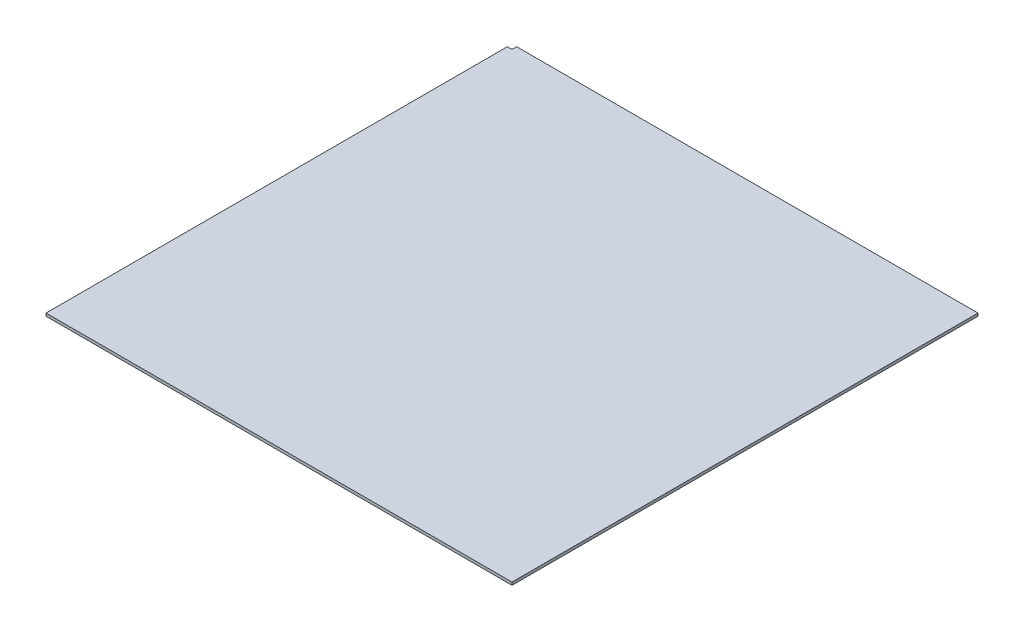
ISO-10303-21;
HEADER;
FILE_DESCRIPTION(('STEP AP214'),'2;1');
FILE_NAME('part.step','',(''),(''),'','','');
FILE_SCHEMA(('AUTOMOTIVE_DESIGN { 1 0 10303 214 1 1 1 1 }'));
ENDSEC;
DATA;
#1=APPLICATION_CONTEXT('core data for automotive mechanical design processes');
#2=APPLICATION_PROTOCOL_DEFINITION('international standard','automotive_design',2000,#1);
#3=PRODUCT_CONTEXT('',#1,'mechanical');
#4=PRODUCT('Part','Part','',(#3));
#5=PRODUCT_RELATED_PRODUCT_CATEGORY('part','',(#4));
#6=PRODUCT_DEFINITION_FORMATION('','',#4);
#7=PRODUCT_DEFINITION_CONTEXT('part definition',#1,'design');
#8=PRODUCT_DEFINITION('design','',#6,#7);
#9=PRODUCT_DEFINITION_SHAPE('','',#8);
#10=(LENGTH_UNIT() NAMED_UNIT(*) SI_UNIT(.MILLI.,.METRE.));
#11=(NAMED_UNIT(*) PLANE_ANGLE_UNIT() SI_UNIT($,.RADIAN.));
#12=(NAMED_UNIT(*) SI_UNIT($,.STERADIAN.) SOLID_ANGLE_UNIT());
#13=UNCERTAINTY_MEASURE_WITH_UNIT(LENGTH_MEASURE(1.E-05),#10,'distance_accuracy_value','');
#14=(GEOMETRIC_REPRESENTATION_CONTEXT(3) GLOBAL_UNCERTAINTY_ASSIGNED_CONTEXT((#13)) GLOBAL_UNIT_ASSIGNED_CONTEXT((#10,
#11,#12)) REPRESENTATION_CONTEXT('',''));
#15=CARTESIAN_POINT('',(0.,0.,0.));
#16=DIRECTION('',(0.,0.,1.));
#17=DIRECTION('',(1.,0.,0.));
#18=AXIS2_PLACEMENT_3D('',#15,#16,#17);
#19=CARTESIAN_POINT('',(500.,3.,-500.));
#20=DIRECTION('',(-1.,0.,0.));
#21=DIRECTION('',(0.,0.,1.));
#22=AXIS2_PLACEMENT_3D('',#19,#20,#21);
#23=PLANE('',#22);
#24=DIRECTION('',(0.,0.,-1.));
#25=VECTOR('',#24,1.);
#26=CARTESIAN_POINT('',(500.,-3.,-500.));
#27=LINE('',#26,#25);
#28=CARTESIAN_POINT('',(500.,-3.,500.));
#29=VERTEX_POINT('',#28);
#30=CARTESIAN_POINT('',(500.,-3.,-500.));
#31=VERTEX_POINT('',#30);
#32=EDGE_CURVE('E116',#29,#31,#27,.T.);
#33=ORIENTED_EDGE('',*,*,#32,.T.);
#34=DIRECTION('',(0.,-1.,0.));
#35=VECTOR('',#34,1.);
#36=CARTESIAN_POINT('',(500.,3.,-500.));
#37=LINE('',#36,#35);
#38=CARTESIAN_POINT('',(500.,3.,-500.));
#39=VERTEX_POINT('',#38);
#40=EDGE_CURVE('E11',#39,#31,#37,.T.);
#41=ORIENTED_EDGE('',*,*,#40,.F.);
#42=DIRECTION('',(0.,0.,-1.));
#43=VECTOR('',#42,1.);
#44=CARTESIAN_POINT('',(500.,3.,-500.));
#45=LINE('',#44,#43);
#46=CARTESIAN_POINT('',(500.,3.,500.));
#47=VERTEX_POINT('',#46);
#48=EDGE_CURVE('E126',#47,#39,#45,.T.);
#49=ORIENTED_EDGE('',*,*,#48,.F.);
#50=DIRECTION('',(0.,-1.,0.));
#51=VECTOR('',#50,1.);
#52=CARTESIAN_POINT('',(500.,3.,500.));
#53=LINE('',#52,#51);
#54=EDGE_CURVE('E112',#47,#29,#53,.T.);
#55=ORIENTED_EDGE('',*,*,#54,.T.);
#56=EDGE_LOOP('',(#33,#41,#49,#55));
#57=FACE_BOUND('',#56,.T.);
#58=ADVANCED_FACE('F32',(#57),#23,.F.);
#59=CARTESIAN_POINT('',(-490.,3.,-500.));
#60=DIRECTION('',(0.,0.,1.));
#61=DIRECTION('',(1.,0.,0.));
#62=AXIS2_PLACEMENT_3D('',#59,#60,#61);
#63=PLANE('',#62);
#64=DIRECTION('',(-1.,0.,0.));
#65=VECTOR('',#64,1.);
#66=CARTESIAN_POINT('',(-490.,-3.,-500.));
#67=LINE('',#66,#65);
#68=CARTESIAN_POINT('',(-490.,-3.,-500.));
#69=VERTEX_POINT('',#68);
#70=EDGE_CURVE('E119',#31,#69,#67,.T.);
#71=ORIENTED_EDGE('',*,*,#70,.T.);
#72=DIRECTION('',(0.,-1.,0.));
#73=VECTOR('',#72,1.);
#74=CARTESIAN_POINT('',(-490.,3.,-500.));
#75=LINE('',#74,#73);
#76=CARTESIAN_POINT('',(-490.,3.,-500.));
#77=VERTEX_POINT('',#76);
#78=EDGE_CURVE('E40',#77,#69,#75,.T.);
#79=ORIENTED_EDGE('',*,*,#78,.F.);
#80=DIRECTION('',(-1.,0.,0.));
#81=VECTOR('',#80,1.);
#82=CARTESIAN_POINT('',(-490.,3.,-500.));
#83=LINE('',#82,#81);
#84=EDGE_CURVE('E85',#39,#77,#83,.T.);
#85=ORIENTED_EDGE('',*,*,#84,.F.);
#86=ORIENTED_EDGE('',*,*,#40,.T.);
#87=EDGE_LOOP('',(#71,#79,#85,#86));
#88=FACE_BOUND('',#87,.T.);
#89=ADVANCED_FACE('F150',(#88),#63,.F.);
#90=CARTESIAN_POINT('',(-490.,3.,-500.));
#91=DIRECTION('',(1.,0.,0.));
#92=DIRECTION('',(0.,0.,-1.));
#93=AXIS2_PLACEMENT_3D('',#90,#91,#92);
#94=PLANE('',#93);
#95=DIRECTION('',(0.,0.,1.));
#96=VECTOR('',#95,1.);
#97=CARTESIAN_POINT('',(-490.,-3.,-500.));
#98=LINE('',#97,#96);
#99=CARTESIAN_POINT('',(-490.,-3.,-490.));
#100=VERTEX_POINT('',#99);
#101=EDGE_CURVE('E121',#69,#100,#98,.T.);
#102=ORIENTED_EDGE('',*,*,#101,.T.);
#103=DIRECTION('',(0.,-1.,0.));
#104=VECTOR('',#103,1.);
#105=CARTESIAN_POINT('',(-490.,3.,-490.));
#106=LINE('',#105,#104);
#107=CARTESIAN_POINT('',(-490.,3.,-490.));
#108=VERTEX_POINT('',#107);
#109=EDGE_CURVE('E107',#108,#100,#106,.T.);
#110=ORIENTED_EDGE('',*,*,#109,.F.);
#111=DIRECTION('',(0.,0.,1.));
#112=VECTOR('',#111,1.);
#113=CARTESIAN_POINT('',(-490.,3.,-500.));
#114=LINE('',#113,#112);
#115=EDGE_CURVE('E98',#77,#108,#114,.T.);
#116=ORIENTED_EDGE('',*,*,#115,.F.);
#117=ORIENTED_EDGE('',*,*,#78,.T.);
#118=EDGE_LOOP('',(#102,#110,#116,#117));
#119=FACE_BOUND('',#118,.T.);
#120=ADVANCED_FACE('F132',(#119),#94,.F.);
#121=CARTESIAN_POINT('',(-500.,3.,-490.));
#122=DIRECTION('',(0.,0.,1.));
#123=DIRECTION('',(1.,0.,0.));
#124=AXIS2_PLACEMENT_3D('',#121,#122,#123);
#125=PLANE('',#124);
#126=DIRECTION('',(-1.,0.,0.));
#127=VECTOR('',#126,1.);
#128=CARTESIAN_POINT('',(-500.,-3.,-490.));
#129=LINE('',#128,#127);
#130=CARTESIAN_POINT('',(-500.,-3.,-490.));
#131=VERTEX_POINT('',#130);
#132=EDGE_CURVE('E106',#100,#131,#129,.T.);
#133=ORIENTED_EDGE('',*,*,#132,.T.);
#134=DIRECTION('',(0.,-1.,0.));
#135=VECTOR('',#134,1.);
#136=CARTESIAN_POINT('',(-500.,3.,-490.));
#137=LINE('',#136,#135);
#138=CARTESIAN_POINT('',(-500.,3.,-490.));
#139=VERTEX_POINT('',#138);
#140=EDGE_CURVE('E103',#139,#131,#137,.T.);
#141=ORIENTED_EDGE('',*,*,#140,.F.);
#142=DIRECTION('',(-1.,0.,0.));
#143=VECTOR('',#142,1.);
#144=CARTESIAN_POINT('',(-500.,3.,-490.));
#145=LINE('',#144,#143);
#146=EDGE_CURVE('E92',#108,#139,#145,.T.);
#147=ORIENTED_EDGE('',*,*,#146,.F.);
#148=ORIENTED_EDGE('',*,*,#109,.T.);
#149=EDGE_LOOP('',(#133,#141,#147,#148));
#150=FACE_BOUND('',#149,.T.);
#151=ADVANCED_FACE('F104',(#150),#125,.F.);
#152=CARTESIAN_POINT('',(-500.,3.,-490.));
#153=DIRECTION('',(1.,0.,0.));
#154=DIRECTION('',(0.,0.,-1.));
#155=AXIS2_PLACEMENT_3D('',#152,#153,#154);
#156=PLANE('',#155);
#157=DIRECTION('',(0.,0.,1.));
#158=VECTOR('',#157,1.);
#159=CARTESIAN_POINT('',(-500.,-3.,-490.));
#160=LINE('',#159,#158);
#161=CARTESIAN_POINT('',(-500.,-3.,500.));
#162=VERTEX_POINT('',#161);
#163=EDGE_CURVE('E71',#131,#162,#160,.T.);
#164=ORIENTED_EDGE('',*,*,#163,.T.);
#165=DIRECTION('',(0.,-1.,0.));
#166=VECTOR('',#165,1.);
#167=CARTESIAN_POINT('',(-500.,3.,500.));
#168=LINE('',#167,#166);
#169=CARTESIAN_POINT('',(-500.,3.,500.));
#170=VERTEX_POINT('',#169);
#171=EDGE_CURVE('E108',#170,#162,#168,.T.);
#172=ORIENTED_EDGE('',*,*,#171,.F.);
#173=DIRECTION('',(0.,0.,1.));
#174=VECTOR('',#173,1.);
#175=CARTESIAN_POINT('',(-500.,3.,-490.));
#176=LINE('',#175,#174);
#177=EDGE_CURVE('E96',#139,#170,#176,.T.);
#178=ORIENTED_EDGE('',*,*,#177,.F.);
#179=ORIENTED_EDGE('',*,*,#140,.T.);
#180=EDGE_LOOP('',(#164,#172,#178,#179));
#181=FACE_BOUND('',#180,.T.);
#182=ADVANCED_FACE('F110',(#181),#156,.F.);
#183=CARTESIAN_POINT('',(-500.,3.,500.));
#184=DIRECTION('',(0.,0.,-1.));
#185=DIRECTION('',(-1.,0.,0.));
#186=AXIS2_PLACEMENT_3D('',#183,#184,#185);
#187=PLANE('',#186);
#188=DIRECTION('',(1.,0.,0.));
#189=VECTOR('',#188,1.);
#190=CARTESIAN_POINT('',(-500.,-3.,500.));
#191=LINE('',#190,#189);
#192=EDGE_CURVE('E77',#162,#29,#191,.T.);
#193=ORIENTED_EDGE('',*,*,#192,.T.);
#194=ORIENTED_EDGE('',*,*,#54,.F.);
#195=DIRECTION('',(1.,0.,0.));
#196=VECTOR('',#195,1.);
#197=CARTESIAN_POINT('',(-500.,3.,500.));
#198=LINE('',#197,#196);
#199=EDGE_CURVE('E48',#170,#47,#198,.T.);
#200=ORIENTED_EDGE('',*,*,#199,.F.);
#201=ORIENTED_EDGE('',*,*,#171,.T.);
#202=EDGE_LOOP('',(#193,#194,#200,#201));
#203=FACE_BOUND('',#202,.T.);
#204=ADVANCED_FACE('F139',(#203),#187,.F.);
#205=CARTESIAN_POINT('',(0.,3.,0.));
#206=DIRECTION('',(0.,1.,0.));
#207=DIRECTION('',(0.,0.,1.));
#208=AXIS2_PLACEMENT_3D('',#205,#206,#207);
#209=PLANE('',#208);
#210=ORIENTED_EDGE('',*,*,#48,.T.);
#211=ORIENTED_EDGE('',*,*,#84,.T.);
#212=ORIENTED_EDGE('',*,*,#115,.T.);
#213=ORIENTED_EDGE('',*,*,#146,.T.);
#214=ORIENTED_EDGE('',*,*,#177,.T.);
#215=ORIENTED_EDGE('',*,*,#199,.T.);
#216=EDGE_LOOP('',(#210,#211,#212,#213,#214,#215));
#217=FACE_BOUND('',#216,.T.);
#218=ADVANCED_FACE('F94',(#217),#209,.T.);
#219=CARTESIAN_POINT('',(0.,-3.,0.));
#220=DIRECTION('',(0.,1.,0.));
#221=DIRECTION('',(0.,0.,1.));
#222=AXIS2_PLACEMENT_3D('',#219,#220,#221);
#223=PLANE('',#222);
#224=ORIENTED_EDGE('',*,*,#32,.F.);
#225=ORIENTED_EDGE('',*,*,#192,.F.);
#226=ORIENTED_EDGE('',*,*,#163,.F.);
#227=ORIENTED_EDGE('',*,*,#132,.F.);
#228=ORIENTED_EDGE('',*,*,#101,.F.);
#229=ORIENTED_EDGE('',*,*,#70,.F.);
#230=EDGE_LOOP('',(#224,#225,#226,#227,#228,#229));
#231=FACE_BOUND('',#230,.T.);
#232=ADVANCED_FACE('F135',(#231),#223,.F.);
#233=CLOSED_SHELL('',(#58,#89,#120,#151,#182,#204,#218,#232));
#234=MANIFOLD_SOLID_BREP('B2',#233);
#235=ADVANCED_BREP_SHAPE_REPRESENTATION('',(#18,#234),#14);
#236=SHAPE_DEFINITION_REPRESENTATION(#9,#235);
ENDSEC;
END-ISO-10303-21;
